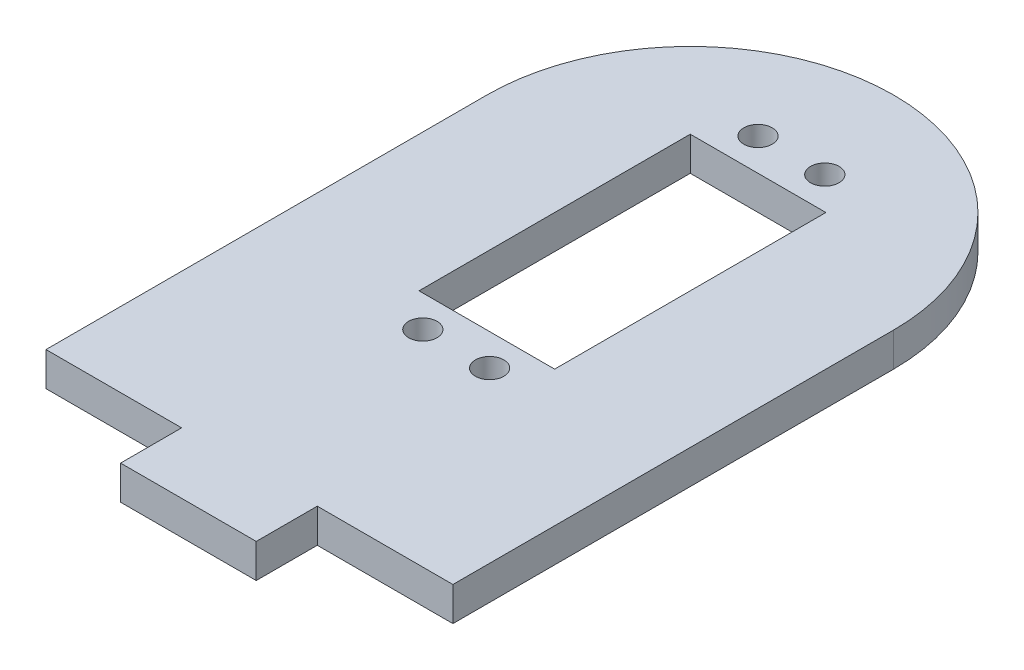
ISO-10303-21;
HEADER;
FILE_DESCRIPTION(('STEP AP214'),'2;1');
FILE_NAME('part.step','',(''),(''),'','','');
FILE_SCHEMA(('AUTOMOTIVE_DESIGN { 1 0 10303 214 1 1 1 1 }'));
ENDSEC;
DATA;
#1=APPLICATION_CONTEXT('core data for automotive mechanical design processes');
#2=APPLICATION_PROTOCOL_DEFINITION('international standard','automotive_design',2000,#1);
#3=PRODUCT_CONTEXT('',#1,'mechanical');
#4=PRODUCT('Part','Part','',(#3));
#5=PRODUCT_RELATED_PRODUCT_CATEGORY('part','',(#4));
#6=PRODUCT_DEFINITION_FORMATION('','',#4);
#7=PRODUCT_DEFINITION_CONTEXT('part definition',#1,'design');
#8=PRODUCT_DEFINITION('design','',#6,#7);
#9=PRODUCT_DEFINITION_SHAPE('','',#8);
#10=(LENGTH_UNIT() NAMED_UNIT(*) SI_UNIT(.MILLI.,.METRE.));
#11=(NAMED_UNIT(*) PLANE_ANGLE_UNIT() SI_UNIT($,.RADIAN.));
#12=(NAMED_UNIT(*) SI_UNIT($,.STERADIAN.) SOLID_ANGLE_UNIT());
#13=UNCERTAINTY_MEASURE_WITH_UNIT(LENGTH_MEASURE(1.E-05),#10,'distance_accuracy_value','');
#14=(GEOMETRIC_REPRESENTATION_CONTEXT(3) GLOBAL_UNCERTAINTY_ASSIGNED_CONTEXT((#13)) GLOBAL_UNIT_ASSIGNED_CONTEXT((#10,
#11,#12)) REPRESENTATION_CONTEXT('',''));
#15=CARTESIAN_POINT('',(0.,0.,0.));
#16=DIRECTION('',(0.,0.,1.));
#17=DIRECTION('',(1.,0.,0.));
#18=AXIS2_PLACEMENT_3D('',#15,#16,#17);
#19=CARTESIAN_POINT('',(0.,5.,32.5));
#20=DIRECTION('',(0.,0.,-1.));
#21=DIRECTION('',(-1.,0.,0.));
#22=AXIS2_PLACEMENT_3D('',#19,#20,#21);
#23=PLANE('',#22);
#24=DIRECTION('',(1.,0.,0.));
#25=VECTOR('',#24,1.);
#26=CARTESIAN_POINT('',(0.,0.,32.5));
#27=LINE('',#26,#25);
#28=CARTESIAN_POINT('',(-30.,0.,32.5));
#29=VERTEX_POINT('',#28);
#30=CARTESIAN_POINT('',(-9.99999999999999,0.,32.5));
#31=VERTEX_POINT('',#30);
#32=EDGE_CURVE('E162',#29,#31,#27,.T.);
#33=ORIENTED_EDGE('',*,*,#32,.T.);
#34=DIRECTION('',(0.,-1.,0.));
#35=VECTOR('',#34,1.);
#36=CARTESIAN_POINT('',(-9.99999999999999,5.,32.5));
#37=LINE('',#36,#35);
#38=CARTESIAN_POINT('',(-9.99999999999999,5.,32.5));
#39=VERTEX_POINT('',#38);
#40=EDGE_CURVE('E11',#39,#31,#37,.T.);
#41=ORIENTED_EDGE('',*,*,#40,.F.);
#42=DIRECTION('',(1.,0.,0.));
#43=VECTOR('',#42,1.);
#44=CARTESIAN_POINT('',(0.,5.,32.5));
#45=LINE('',#44,#43);
#46=CARTESIAN_POINT('',(-30.,5.,32.5));
#47=VERTEX_POINT('',#46);
#48=EDGE_CURVE('E166',#47,#39,#45,.T.);
#49=ORIENTED_EDGE('',*,*,#48,.F.);
#50=DIRECTION('',(0.,-1.,0.));
#51=VECTOR('',#50,1.);
#52=CARTESIAN_POINT('',(-30.,5.,32.5));
#53=LINE('',#52,#51);
#54=EDGE_CURVE('E184',#47,#29,#53,.T.);
#55=ORIENTED_EDGE('',*,*,#54,.T.);
#56=EDGE_LOOP('',(#33,#41,#49,#55));
#57=FACE_BOUND('',#56,.T.);
#58=ADVANCED_FACE('F35',(#57),#23,.F.);
#59=CARTESIAN_POINT('',(-9.99999999999999,5.,0.));
#60=DIRECTION('',(1.,0.,0.));
#61=DIRECTION('',(0.,0.,-1.));
#62=AXIS2_PLACEMENT_3D('',#59,#60,#61);
#63=PLANE('',#62);
#64=DIRECTION('',(0.,0.,1.));
#65=VECTOR('',#64,1.);
#66=CARTESIAN_POINT('',(-9.99999999999999,0.,0.));
#67=LINE('',#66,#65);
#68=CARTESIAN_POINT('',(-9.99999999999999,0.,41.5));
#69=VERTEX_POINT('',#68);
#70=EDGE_CURVE('E187',#31,#69,#67,.T.);
#71=ORIENTED_EDGE('',*,*,#70,.T.);
#72=DIRECTION('',(0.,-1.,0.));
#73=VECTOR('',#72,1.);
#74=CARTESIAN_POINT('',(-9.99999999999999,5.,41.5));
#75=LINE('',#74,#73);
#76=CARTESIAN_POINT('',(-9.99999999999999,5.,41.5));
#77=VERTEX_POINT('',#76);
#78=EDGE_CURVE('E44',#77,#69,#75,.T.);
#79=ORIENTED_EDGE('',*,*,#78,.F.);
#80=DIRECTION('',(0.,0.,1.));
#81=VECTOR('',#80,1.);
#82=CARTESIAN_POINT('',(-9.99999999999999,5.,0.));
#83=LINE('',#82,#81);
#84=EDGE_CURVE('E169',#39,#77,#83,.T.);
#85=ORIENTED_EDGE('',*,*,#84,.F.);
#86=ORIENTED_EDGE('',*,*,#40,.T.);
#87=EDGE_LOOP('',(#71,#79,#85,#86));
#88=FACE_BOUND('',#87,.T.);
#89=ADVANCED_FACE('F37',(#88),#63,.F.);
#90=CARTESIAN_POINT('',(0.,5.,41.5));
#91=DIRECTION('',(0.,0.,-1.));
#92=DIRECTION('',(-1.,0.,0.));
#93=AXIS2_PLACEMENT_3D('',#90,#91,#92);
#94=PLANE('',#93);
#95=DIRECTION('',(1.,0.,0.));
#96=VECTOR('',#95,1.);
#97=CARTESIAN_POINT('',(0.,0.,41.5));
#98=LINE('',#97,#96);
#99=CARTESIAN_POINT('',(10.,0.,41.5));
#100=VERTEX_POINT('',#99);
#101=EDGE_CURVE('E190',#69,#100,#98,.T.);
#102=ORIENTED_EDGE('',*,*,#101,.T.);
#103=DIRECTION('',(0.,-1.,0.));
#104=VECTOR('',#103,1.);
#105=CARTESIAN_POINT('',(10.,5.,41.5));
#106=LINE('',#105,#104);
#107=CARTESIAN_POINT('',(10.,5.,41.5));
#108=VERTEX_POINT('',#107);
#109=EDGE_CURVE('E213',#108,#100,#106,.T.);
#110=ORIENTED_EDGE('',*,*,#109,.F.);
#111=DIRECTION('',(1.,0.,0.));
#112=VECTOR('',#111,1.);
#113=CARTESIAN_POINT('',(0.,5.,41.5));
#114=LINE('',#113,#112);
#115=EDGE_CURVE('E173',#77,#108,#114,.T.);
#116=ORIENTED_EDGE('',*,*,#115,.F.);
#117=ORIENTED_EDGE('',*,*,#78,.T.);
#118=EDGE_LOOP('',(#102,#110,#116,#117));
#119=FACE_BOUND('',#118,.T.);
#120=ADVANCED_FACE('F251',(#119),#94,.F.);
#121=CARTESIAN_POINT('',(10.,5.,0.));
#122=DIRECTION('',(-1.,0.,0.));
#123=DIRECTION('',(0.,0.,1.));
#124=AXIS2_PLACEMENT_3D('',#121,#122,#123);
#125=PLANE('',#124);
#126=DIRECTION('',(0.,0.,-1.));
#127=VECTOR('',#126,1.);
#128=CARTESIAN_POINT('',(10.,0.,0.));
#129=LINE('',#128,#127);
#130=CARTESIAN_POINT('',(10.,0.,32.5));
#131=VERTEX_POINT('',#130);
#132=EDGE_CURVE('E192',#100,#131,#129,.T.);
#133=ORIENTED_EDGE('',*,*,#132,.T.);
#134=DIRECTION('',(0.,-1.,0.));
#135=VECTOR('',#134,1.);
#136=CARTESIAN_POINT('',(10.,5.,32.5));
#137=LINE('',#136,#135);
#138=CARTESIAN_POINT('',(10.,5.,32.5));
#139=VERTEX_POINT('',#138);
#140=EDGE_CURVE('E210',#139,#131,#137,.T.);
#141=ORIENTED_EDGE('',*,*,#140,.F.);
#142=DIRECTION('',(0.,0.,-1.));
#143=VECTOR('',#142,1.);
#144=CARTESIAN_POINT('',(10.,5.,0.));
#145=LINE('',#144,#143);
#146=EDGE_CURVE('E175',#108,#139,#145,.T.);
#147=ORIENTED_EDGE('',*,*,#146,.F.);
#148=ORIENTED_EDGE('',*,*,#109,.T.);
#149=EDGE_LOOP('',(#133,#141,#147,#148));
#150=FACE_BOUND('',#149,.T.);
#151=ADVANCED_FACE('F257',(#150),#125,.F.);
#152=CARTESIAN_POINT('',(30.,0.,32.5));
#153=VERTEX_POINT('',#152);
#154=EDGE_CURVE('E188',#131,#153,#27,.T.);
#155=ORIENTED_EDGE('',*,*,#154,.T.);
#156=DIRECTION('',(0.,-1.,0.));
#157=VECTOR('',#156,1.);
#158=CARTESIAN_POINT('',(30.,5.,32.5));
#159=LINE('',#158,#157);
#160=CARTESIAN_POINT('',(30.,5.,32.5));
#161=VERTEX_POINT('',#160);
#162=EDGE_CURVE('E207',#161,#153,#159,.T.);
#163=ORIENTED_EDGE('',*,*,#162,.F.);
#164=EDGE_CURVE('E171',#139,#161,#45,.T.);
#165=ORIENTED_EDGE('',*,*,#164,.F.);
#166=ORIENTED_EDGE('',*,*,#140,.T.);
#167=EDGE_LOOP('',(#155,#163,#165,#166));
#168=FACE_BOUND('',#167,.T.);
#169=ADVANCED_FACE('F247',(#168),#23,.F.);
#170=CARTESIAN_POINT('',(30.,5.,0.));
#171=DIRECTION('',(-1.,0.,0.));
#172=DIRECTION('',(0.,0.,1.));
#173=AXIS2_PLACEMENT_3D('',#170,#171,#172);
#174=PLANE('',#173);
#175=DIRECTION('',(0.,0.,-1.));
#176=VECTOR('',#175,1.);
#177=CARTESIAN_POINT('',(30.,0.,0.));
#178=LINE('',#177,#176);
#179=CARTESIAN_POINT('',(30.,0.,-32.5));
#180=VERTEX_POINT('',#179);
#181=EDGE_CURVE('E194',#153,#180,#178,.T.);
#182=ORIENTED_EDGE('',*,*,#181,.T.);
#183=DIRECTION('',(0.,-1.,0.));
#184=VECTOR('',#183,1.);
#185=CARTESIAN_POINT('',(30.,5.,-32.5));
#186=LINE('',#185,#184);
#187=CARTESIAN_POINT('',(30.,5.,-32.5));
#188=VERTEX_POINT('',#187);
#189=EDGE_CURVE('E204',#188,#180,#186,.T.);
#190=ORIENTED_EDGE('',*,*,#189,.F.);
#191=DIRECTION('',(0.,0.,-1.));
#192=VECTOR('',#191,1.);
#193=CARTESIAN_POINT('',(30.,5.,0.));
#194=LINE('',#193,#192);
#195=EDGE_CURVE('E177',#161,#188,#194,.T.);
#196=ORIENTED_EDGE('',*,*,#195,.F.);
#197=ORIENTED_EDGE('',*,*,#162,.T.);
#198=EDGE_LOOP('',(#182,#190,#196,#197));
#199=FACE_BOUND('',#198,.T.);
#200=ADVANCED_FACE('F256',(#199),#174,.F.);
#201=CARTESIAN_POINT('',(0.,5.,-32.5));
#202=DIRECTION('',(0.,-1.,0.));
#203=DIRECTION('',(0.,0.,-1.));
#204=AXIS2_PLACEMENT_3D('',#201,#202,#203);
#205=CYLINDRICAL_SURFACE('',#204,30.);
#206=CARTESIAN_POINT('',(0.,0.,-32.5));
#207=DIRECTION('',(0.,1.,0.));
#208=DIRECTION('',(0.,0.,1.));
#209=AXIS2_PLACEMENT_3D('',#206,#207,#208);
#210=CIRCLE('',#209,30.);
#211=CARTESIAN_POINT('',(-30.,0.,-32.5));
#212=VERTEX_POINT('',#211);
#213=EDGE_CURVE('E196',#180,#212,#210,.T.);
#214=ORIENTED_EDGE('',*,*,#213,.T.);
#215=DIRECTION('',(0.,-1.,0.));
#216=VECTOR('',#215,1.);
#217=CARTESIAN_POINT('',(-30.,5.,-32.5));
#218=LINE('',#217,#216);
#219=CARTESIAN_POINT('',(-30.,5.,-32.5));
#220=VERTEX_POINT('',#219);
#221=EDGE_CURVE('E202',#220,#212,#218,.T.);
#222=ORIENTED_EDGE('',*,*,#221,.F.);
#223=CARTESIAN_POINT('',(0.,5.,-32.5));
#224=DIRECTION('',(0.,1.,0.));
#225=DIRECTION('',(0.,0.,1.));
#226=AXIS2_PLACEMENT_3D('',#223,#224,#225);
#227=CIRCLE('',#226,30.);
#228=EDGE_CURVE('E179',#188,#220,#227,.T.);
#229=ORIENTED_EDGE('',*,*,#228,.F.);
#230=ORIENTED_EDGE('',*,*,#189,.T.);
#231=EDGE_LOOP('',(#214,#222,#229,#230));
#232=FACE_BOUND('',#231,.T.);
#233=ADVANCED_FACE('F263',(#232),#205,.T.);
#234=CARTESIAN_POINT('',(-30.,5.,0.));
#235=DIRECTION('',(-1.,0.,0.));
#236=DIRECTION('',(0.,0.,1.));
#237=AXIS2_PLACEMENT_3D('',#234,#235,#236);
#238=PLANE('',#237);
#239=DIRECTION('',(0.,0.,-1.));
#240=VECTOR('',#239,1.);
#241=CARTESIAN_POINT('',(-30.,0.,0.));
#242=LINE('',#241,#240);
#243=EDGE_CURVE('E170',#29,#212,#242,.T.);
#244=ORIENTED_EDGE('',*,*,#243,.F.);
#245=ORIENTED_EDGE('',*,*,#54,.F.);
#246=DIRECTION('',(0.,0.,-1.));
#247=VECTOR('',#246,1.);
#248=CARTESIAN_POINT('',(-30.,5.,0.));
#249=LINE('',#248,#247);
#250=EDGE_CURVE('E181',#47,#220,#249,.T.);
#251=ORIENTED_EDGE('',*,*,#250,.T.);
#252=ORIENTED_EDGE('',*,*,#221,.T.);
#253=EDGE_LOOP('',(#244,#245,#251,#252));
#254=FACE_BOUND('',#253,.T.);
#255=ADVANCED_FACE('F292',(#254),#238,.T.);
#256=CARTESIAN_POINT('',(0.,5.,0.));
#257=DIRECTION('',(0.,1.,0.));
#258=DIRECTION('',(0.,0.,1.));
#259=AXIS2_PLACEMENT_3D('',#256,#257,#258);
#260=PLANE('',#259);
#261=CARTESIAN_POINT('',(-4.77499999999983,5.,-47.2611456180002));
#262=DIRECTION('',(0.,-1.,0.));
#263=DIRECTION('',(0.,0.,-1.));
#264=AXIS2_PLACEMENT_3D('',#261,#262,#263);
#265=CIRCLE('',#264,2.1000000001068);
#266=CARTESIAN_POINT('',(-4.77499999999983,5.,-49.361145618107));
#267=VERTEX_POINT('',#266);
#268=EDGE_CURVE('E337',#267,#267,#265,.T.);
#269=ORIENTED_EDGE('',*,*,#268,.T.);
#270=EDGE_LOOP('',(#269));
#271=FACE_BOUND('',#270,.T.);
#272=CARTESIAN_POINT('',(5.07500000000017,5.,-47.2611456180002));
#273=DIRECTION('',(0.,-1.,0.));
#274=DIRECTION('',(0.,0.,-1.));
#275=AXIS2_PLACEMENT_3D('',#272,#273,#274);
#276=CIRCLE('',#275,2.10000000010679);
#277=CARTESIAN_POINT('',(5.07500000000017,5.,-49.361145618107));
#278=VERTEX_POINT('',#277);
#279=EDGE_CURVE('E332',#278,#278,#276,.T.);
#280=ORIENTED_EDGE('',*,*,#279,.T.);
#281=EDGE_LOOP('',(#280));
#282=FACE_BOUND('',#281,.T.);
#283=CARTESIAN_POINT('',(5.07500000000057,5.,2.16114561800006));
#284=DIRECTION('',(0.,-1.,0.));
#285=DIRECTION('',(0.,0.,-1.));
#286=AXIS2_PLACEMENT_3D('',#283,#284,#285);
#287=CIRCLE('',#286,2.10000000010657);
#288=CARTESIAN_POINT('',(5.07500000000057,5.,0.061145617893488));
#289=VERTEX_POINT('',#288);
#290=EDGE_CURVE('E330',#289,#289,#287,.T.);
#291=ORIENTED_EDGE('',*,*,#290,.T.);
#292=EDGE_LOOP('',(#291));
#293=FACE_BOUND('',#292,.T.);
#294=CARTESIAN_POINT('',(-4.77499999999943,5.,2.16114561800005));
#295=DIRECTION('',(0.,-1.,0.));
#296=DIRECTION('',(0.,0.,-1.));
#297=AXIS2_PLACEMENT_3D('',#294,#295,#296);
#298=CIRCLE('',#297,2.10000000010658);
#299=CARTESIAN_POINT('',(-4.77499999999943,5.,0.0611456178934719));
#300=VERTEX_POINT('',#299);
#301=EDGE_CURVE('E150',#300,#300,#298,.T.);
#302=ORIENTED_EDGE('',*,*,#301,.T.);
#303=EDGE_LOOP('',(#302));
#304=FACE_BOUND('',#303,.T.);
#305=DIRECTION('',(0.,0.,-1.));
#306=VECTOR('',#305,1.);
#307=CARTESIAN_POINT('',(10.,5.,-42.5));
#308=LINE('',#307,#306);
#309=CARTESIAN_POINT('',(10.,5.,-2.5));
#310=VERTEX_POINT('',#309);
#311=CARTESIAN_POINT('',(10.,5.,-42.5));
#312=VERTEX_POINT('',#311);
#313=EDGE_CURVE('E52',#310,#312,#308,.T.);
#314=ORIENTED_EDGE('',*,*,#313,.F.);
#315=DIRECTION('',(1.,0.,0.));
#316=VECTOR('',#315,1.);
#317=CARTESIAN_POINT('',(-9.99999999999999,5.,-2.5));
#318=LINE('',#317,#316);
#319=CARTESIAN_POINT('',(-9.99999999999999,5.,-2.5));
#320=VERTEX_POINT('',#319);
#321=EDGE_CURVE('E144',#320,#310,#318,.T.);
#322=ORIENTED_EDGE('',*,*,#321,.F.);
#323=DIRECTION('',(0.,0.,1.));
#324=VECTOR('',#323,1.);
#325=CARTESIAN_POINT('',(-9.99999999999999,5.,-42.5));
#326=LINE('',#325,#324);
#327=CARTESIAN_POINT('',(-9.99999999999999,5.,-42.5));
#328=VERTEX_POINT('',#327);
#329=EDGE_CURVE('E147',#328,#320,#326,.T.);
#330=ORIENTED_EDGE('',*,*,#329,.F.);
#331=DIRECTION('',(-1.,0.,0.));
#332=VECTOR('',#331,1.);
#333=CARTESIAN_POINT('',(-9.99999999999999,5.,-42.5));
#334=LINE('',#333,#332);
#335=EDGE_CURVE('E156',#312,#328,#334,.T.);
#336=ORIENTED_EDGE('',*,*,#335,.F.);
#337=EDGE_LOOP('',(#314,#322,#330,#336));
#338=FACE_BOUND('',#337,.T.);
#339=ORIENTED_EDGE('',*,*,#48,.T.);
#340=ORIENTED_EDGE('',*,*,#84,.T.);
#341=ORIENTED_EDGE('',*,*,#115,.T.);
#342=ORIENTED_EDGE('',*,*,#146,.T.);
#343=ORIENTED_EDGE('',*,*,#164,.T.);
#344=ORIENTED_EDGE('',*,*,#195,.T.);
#345=ORIENTED_EDGE('',*,*,#228,.T.);
#346=ORIENTED_EDGE('',*,*,#250,.F.);
#347=EDGE_LOOP('',(#339,#340,#341,#342,#343,#344,#345,#346));
#348=FACE_BOUND('',#347,.T.);
#349=ADVANCED_FACE('F282',(#271,#282,#293,#304,#338,#348),#260,.T.);
#350=CARTESIAN_POINT('',(0.,0.,0.));
#351=DIRECTION('',(0.,1.,0.));
#352=DIRECTION('',(0.,0.,1.));
#353=AXIS2_PLACEMENT_3D('',#350,#351,#352);
#354=PLANE('',#353);
#355=CARTESIAN_POINT('',(-4.77499999999983,0.,-47.2611456180002));
#356=DIRECTION('',(0.,1.,0.));
#357=DIRECTION('',(0.,0.,1.));
#358=AXIS2_PLACEMENT_3D('',#355,#356,#357);
#359=CIRCLE('',#358,2.1000000001068);
#360=CARTESIAN_POINT('',(-4.77499999999983,0.,-45.1611456178934));
#361=VERTEX_POINT('',#360);
#362=EDGE_CURVE('E39',#361,#361,#359,.T.);
#363=ORIENTED_EDGE('',*,*,#362,.T.);
#364=EDGE_LOOP('',(#363));
#365=FACE_BOUND('',#364,.T.);
#366=CARTESIAN_POINT('',(5.07500000000017,0.,-47.2611456180002));
#367=DIRECTION('',(0.,1.,0.));
#368=DIRECTION('',(0.,0.,1.));
#369=AXIS2_PLACEMENT_3D('',#366,#367,#368);
#370=CIRCLE('',#369,2.10000000010679);
#371=CARTESIAN_POINT('',(5.07500000000017,0.,-45.1611456178934));
#372=VERTEX_POINT('',#371);
#373=EDGE_CURVE('E223',#372,#372,#370,.T.);
#374=ORIENTED_EDGE('',*,*,#373,.T.);
#375=EDGE_LOOP('',(#374));
#376=FACE_BOUND('',#375,.T.);
#377=CARTESIAN_POINT('',(5.07500000000057,0.,2.16114561800006));
#378=DIRECTION('',(0.,1.,0.));
#379=DIRECTION('',(0.,0.,1.));
#380=AXIS2_PLACEMENT_3D('',#377,#378,#379);
#381=CIRCLE('',#380,2.10000000010657);
#382=CARTESIAN_POINT('',(5.07500000000057,0.,4.26114561810663));
#383=VERTEX_POINT('',#382);
#384=EDGE_CURVE('E221',#383,#383,#381,.T.);
#385=ORIENTED_EDGE('',*,*,#384,.T.);
#386=EDGE_LOOP('',(#385));
#387=FACE_BOUND('',#386,.T.);
#388=CARTESIAN_POINT('',(-4.77499999999943,0.,2.16114561800005));
#389=DIRECTION('',(0.,1.,0.));
#390=DIRECTION('',(0.,0.,1.));
#391=AXIS2_PLACEMENT_3D('',#388,#389,#390);
#392=CIRCLE('',#391,2.10000000010658);
#393=CARTESIAN_POINT('',(-4.77499999999943,0.,4.26114561810664));
#394=VERTEX_POINT('',#393);
#395=EDGE_CURVE('E218',#394,#394,#392,.T.);
#396=ORIENTED_EDGE('',*,*,#395,.T.);
#397=EDGE_LOOP('',(#396));
#398=FACE_BOUND('',#397,.T.);
#399=DIRECTION('',(1.,0.,0.));
#400=VECTOR('',#399,1.);
#401=CARTESIAN_POINT('',(-9.99999999999999,0.,-2.5));
#402=LINE('',#401,#400);
#403=CARTESIAN_POINT('',(-9.99999999999999,0.,-2.5));
#404=VERTEX_POINT('',#403);
#405=CARTESIAN_POINT('',(10.,0.,-2.5));
#406=VERTEX_POINT('',#405);
#407=EDGE_CURVE('E134',#404,#406,#402,.T.);
#408=ORIENTED_EDGE('',*,*,#407,.T.);
#409=DIRECTION('',(0.,0.,-1.));
#410=VECTOR('',#409,1.);
#411=CARTESIAN_POINT('',(10.,0.,-42.5));
#412=LINE('',#411,#410);
#413=CARTESIAN_POINT('',(10.,0.,-42.5));
#414=VERTEX_POINT('',#413);
#415=EDGE_CURVE('E128',#406,#414,#412,.T.);
#416=ORIENTED_EDGE('',*,*,#415,.T.);
#417=DIRECTION('',(-1.,0.,0.));
#418=VECTOR('',#417,1.);
#419=CARTESIAN_POINT('',(-9.99999999999999,0.,-42.5));
#420=LINE('',#419,#418);
#421=CARTESIAN_POINT('',(-9.99999999999999,0.,-42.5));
#422=VERTEX_POINT('',#421);
#423=EDGE_CURVE('E137',#414,#422,#420,.T.);
#424=ORIENTED_EDGE('',*,*,#423,.T.);
#425=DIRECTION('',(0.,0.,1.));
#426=VECTOR('',#425,1.);
#427=CARTESIAN_POINT('',(-9.99999999999999,0.,-42.5));
#428=LINE('',#427,#426);
#429=EDGE_CURVE('E60',#422,#404,#428,.T.);
#430=ORIENTED_EDGE('',*,*,#429,.T.);
#431=EDGE_LOOP('',(#408,#416,#424,#430));
#432=FACE_BOUND('',#431,.T.);
#433=ORIENTED_EDGE('',*,*,#32,.F.);
#434=ORIENTED_EDGE('',*,*,#243,.T.);
#435=ORIENTED_EDGE('',*,*,#213,.F.);
#436=ORIENTED_EDGE('',*,*,#181,.F.);
#437=ORIENTED_EDGE('',*,*,#154,.F.);
#438=ORIENTED_EDGE('',*,*,#132,.F.);
#439=ORIENTED_EDGE('',*,*,#101,.F.);
#440=ORIENTED_EDGE('',*,*,#70,.F.);
#441=EDGE_LOOP('',(#433,#434,#435,#436,#437,#438,#439,#440));
#442=FACE_BOUND('',#441,.T.);
#443=ADVANCED_FACE('F141',(#365,#376,#387,#398,#432,#442),#354,.F.);
#444=CARTESIAN_POINT('',(10.,0.,-42.5));
#445=DIRECTION('',(1.,0.,0.));
#446=DIRECTION('',(0.,0.,-1.));
#447=AXIS2_PLACEMENT_3D('',#444,#445,#446);
#448=PLANE('',#447);
#449=ORIENTED_EDGE('',*,*,#313,.T.);
#450=DIRECTION('',(0.,1.,0.));
#451=VECTOR('',#450,1.);
#452=CARTESIAN_POINT('',(10.,0.,-42.5));
#453=LINE('',#452,#451);
#454=EDGE_CURVE('E124',#414,#312,#453,.T.);
#455=ORIENTED_EDGE('',*,*,#454,.F.);
#456=ORIENTED_EDGE('',*,*,#415,.F.);
#457=DIRECTION('',(0.,1.,0.));
#458=VECTOR('',#457,1.);
#459=CARTESIAN_POINT('',(10.,0.,-2.5));
#460=LINE('',#459,#458);
#461=EDGE_CURVE('E160',#406,#310,#460,.T.);
#462=ORIENTED_EDGE('',*,*,#461,.T.);
#463=EDGE_LOOP('',(#449,#455,#456,#462));
#464=FACE_BOUND('',#463,.T.);
#465=ADVANCED_FACE('F126',(#464),#448,.F.);
#466=CARTESIAN_POINT('',(-9.99999999999999,0.,-2.5));
#467=DIRECTION('',(0.,0.,1.));
#468=DIRECTION('',(1.,0.,0.));
#469=AXIS2_PLACEMENT_3D('',#466,#467,#468);
#470=PLANE('',#469);
#471=ORIENTED_EDGE('',*,*,#321,.T.);
#472=ORIENTED_EDGE('',*,*,#461,.F.);
#473=ORIENTED_EDGE('',*,*,#407,.F.);
#474=DIRECTION('',(0.,1.,0.));
#475=VECTOR('',#474,1.);
#476=CARTESIAN_POINT('',(-9.99999999999999,0.,-2.5));
#477=LINE('',#476,#475);
#478=EDGE_CURVE('E163',#404,#320,#477,.T.);
#479=ORIENTED_EDGE('',*,*,#478,.T.);
#480=EDGE_LOOP('',(#471,#472,#473,#479));
#481=FACE_BOUND('',#480,.T.);
#482=ADVANCED_FACE('F308',(#481),#470,.F.);
#483=CARTESIAN_POINT('',(-9.99999999999999,0.,-42.5));
#484=DIRECTION('',(-1.,0.,0.));
#485=DIRECTION('',(0.,0.,1.));
#486=AXIS2_PLACEMENT_3D('',#483,#484,#485);
#487=PLANE('',#486);
#488=ORIENTED_EDGE('',*,*,#329,.T.);
#489=ORIENTED_EDGE('',*,*,#478,.F.);
#490=ORIENTED_EDGE('',*,*,#429,.F.);
#491=DIRECTION('',(0.,1.,0.));
#492=VECTOR('',#491,1.);
#493=CARTESIAN_POINT('',(-9.99999999999999,0.,-42.5));
#494=LINE('',#493,#492);
#495=EDGE_CURVE('E133',#422,#328,#494,.T.);
#496=ORIENTED_EDGE('',*,*,#495,.T.);
#497=EDGE_LOOP('',(#488,#489,#490,#496));
#498=FACE_BOUND('',#497,.T.);
#499=ADVANCED_FACE('F312',(#498),#487,.F.);
#500=CARTESIAN_POINT('',(-9.99999999999999,0.,-42.5));
#501=DIRECTION('',(0.,0.,-1.));
#502=DIRECTION('',(-1.,0.,0.));
#503=AXIS2_PLACEMENT_3D('',#500,#501,#502);
#504=PLANE('',#503);
#505=ORIENTED_EDGE('',*,*,#335,.T.);
#506=ORIENTED_EDGE('',*,*,#495,.F.);
#507=ORIENTED_EDGE('',*,*,#423,.F.);
#508=ORIENTED_EDGE('',*,*,#454,.T.);
#509=EDGE_LOOP('',(#505,#506,#507,#508));
#510=FACE_BOUND('',#509,.T.);
#511=ADVANCED_FACE('F138',(#510),#504,.F.);
#512=CARTESIAN_POINT('',(-4.77499999999943,5.,2.16114561800005));
#513=DIRECTION('',(0.,-1.,0.));
#514=DIRECTION('',(0.,0.,-1.));
#515=AXIS2_PLACEMENT_3D('',#512,#513,#514);
#516=CYLINDRICAL_SURFACE('',#515,2.10000000010658);
#517=ORIENTED_EDGE('',*,*,#301,.F.);
#518=EDGE_LOOP('',(#517));
#519=FACE_BOUND('',#518,.T.);
#520=ORIENTED_EDGE('',*,*,#395,.F.);
#521=EDGE_LOOP('',(#520));
#522=FACE_BOUND('',#521,.T.);
#523=ADVANCED_FACE('F311',(#519,#522),#516,.F.);
#524=CARTESIAN_POINT('',(5.07500000000057,5.,2.16114561800006));
#525=DIRECTION('',(0.,-1.,0.));
#526=DIRECTION('',(0.,0.,-1.));
#527=AXIS2_PLACEMENT_3D('',#524,#525,#526);
#528=CYLINDRICAL_SURFACE('',#527,2.10000000010657);
#529=ORIENTED_EDGE('',*,*,#290,.F.);
#530=EDGE_LOOP('',(#529));
#531=FACE_BOUND('',#530,.T.);
#532=ORIENTED_EDGE('',*,*,#384,.F.);
#533=EDGE_LOOP('',(#532));
#534=FACE_BOUND('',#533,.T.);
#535=ADVANCED_FACE('F239',(#531,#534),#528,.F.);
#536=CARTESIAN_POINT('',(5.07500000000017,5.,-47.2611456180002));
#537=DIRECTION('',(0.,-1.,0.));
#538=DIRECTION('',(0.,0.,-1.));
#539=AXIS2_PLACEMENT_3D('',#536,#537,#538);
#540=CYLINDRICAL_SURFACE('',#539,2.10000000010679);
#541=ORIENTED_EDGE('',*,*,#279,.F.);
#542=EDGE_LOOP('',(#541));
#543=FACE_BOUND('',#542,.T.);
#544=ORIENTED_EDGE('',*,*,#373,.F.);
#545=EDGE_LOOP('',(#544));
#546=FACE_BOUND('',#545,.T.);
#547=ADVANCED_FACE('F233',(#543,#546),#540,.F.);
#548=CARTESIAN_POINT('',(-4.77499999999983,5.,-47.2611456180002));
#549=DIRECTION('',(0.,-1.,0.));
#550=DIRECTION('',(0.,0.,-1.));
#551=AXIS2_PLACEMENT_3D('',#548,#549,#550);
#552=CYLINDRICAL_SURFACE('',#551,2.1000000001068);
#553=ORIENTED_EDGE('',*,*,#268,.F.);
#554=EDGE_LOOP('',(#553));
#555=FACE_BOUND('',#554,.T.);
#556=ORIENTED_EDGE('',*,*,#362,.F.);
#557=EDGE_LOOP('',(#556));
#558=FACE_BOUND('',#557,.T.);
#559=ADVANCED_FACE('F231',(#555,#558),#552,.F.);
#560=CLOSED_SHELL('',(#58,#89,#120,#151,#169,#200,#233,#255,#349,#443,#465,#482,#499,#511,#523,
#535,#547,#559));
#561=MANIFOLD_SOLID_BREP('B2',#560);
#562=ADVANCED_BREP_SHAPE_REPRESENTATION('',(#18,#561),#14);
#563=SHAPE_DEFINITION_REPRESENTATION(#9,#562);
ENDSEC;
END-ISO-10303-21;
